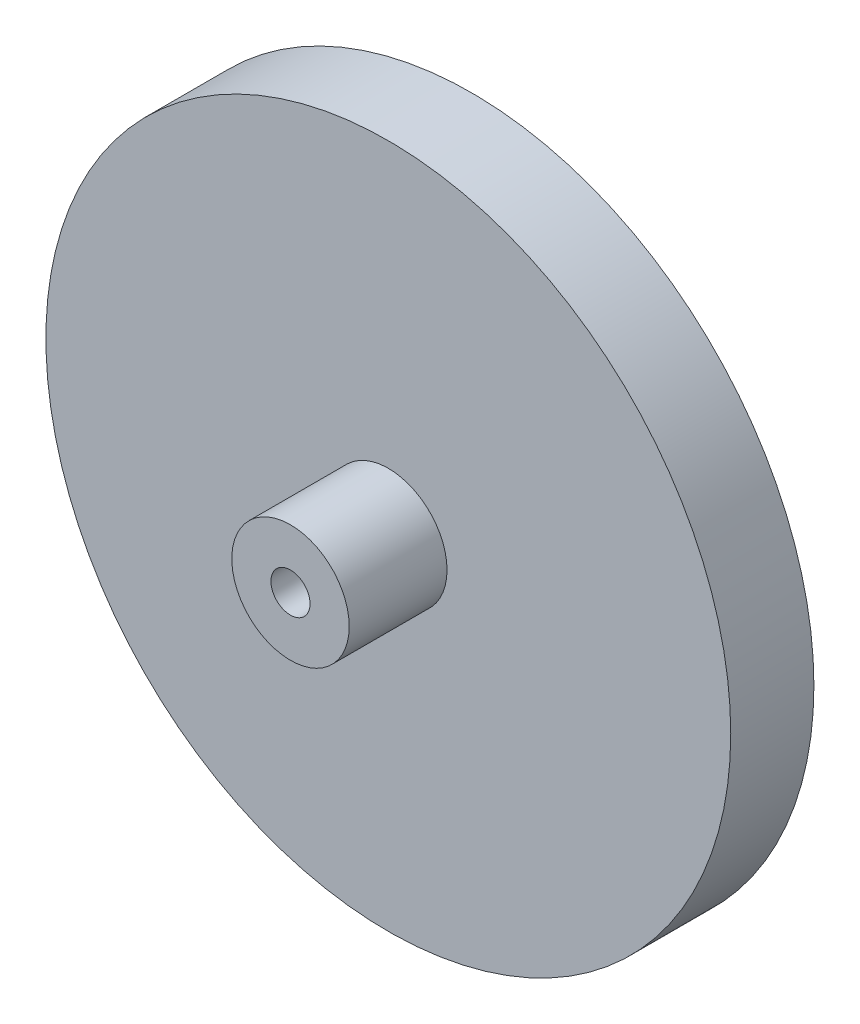
ISO-10303-21;
HEADER;
FILE_DESCRIPTION(('STEP AP214'),'2;1');
FILE_NAME('part.step','',(''),(''),'','','');
FILE_SCHEMA(('AUTOMOTIVE_DESIGN { 1 0 10303 214 1 1 1 1 }'));
ENDSEC;
DATA;
#1=APPLICATION_CONTEXT('core data for automotive mechanical design processes');
#2=APPLICATION_PROTOCOL_DEFINITION('international standard','automotive_design',2000,#1);
#3=PRODUCT_CONTEXT('',#1,'mechanical');
#4=PRODUCT('Part','Part','',(#3));
#5=PRODUCT_RELATED_PRODUCT_CATEGORY('part','',(#4));
#6=PRODUCT_DEFINITION_FORMATION('','',#4);
#7=PRODUCT_DEFINITION_CONTEXT('part definition',#1,'design');
#8=PRODUCT_DEFINITION('design','',#6,#7);
#9=PRODUCT_DEFINITION_SHAPE('','',#8);
#10=(LENGTH_UNIT() NAMED_UNIT(*) SI_UNIT(.MILLI.,.METRE.));
#11=(NAMED_UNIT(*) PLANE_ANGLE_UNIT() SI_UNIT($,.RADIAN.));
#12=(NAMED_UNIT(*) SI_UNIT($,.STERADIAN.) SOLID_ANGLE_UNIT());
#13=UNCERTAINTY_MEASURE_WITH_UNIT(LENGTH_MEASURE(1.E-05),#10,'distance_accuracy_value','');
#14=(GEOMETRIC_REPRESENTATION_CONTEXT(3) GLOBAL_UNCERTAINTY_ASSIGNED_CONTEXT((#13)) GLOBAL_UNIT_ASSIGNED_CONTEXT((#10,
#11,#12)) REPRESENTATION_CONTEXT('',''));
#15=CARTESIAN_POINT('',(0.,0.,0.));
#16=DIRECTION('',(0.,0.,1.));
#17=DIRECTION('',(1.,0.,0.));
#18=AXIS2_PLACEMENT_3D('',#15,#16,#17);
#19=CARTESIAN_POINT('',(0.,0.,8.5));
#20=DIRECTION('',(0.,0.,1.));
#21=DIRECTION('',(1.,0.,0.));
#22=AXIS2_PLACEMENT_3D('',#19,#20,#21);
#23=PLANE('',#22);
#24=CARTESIAN_POINT('',(0.,0.,8.5));
#25=DIRECTION('',(0.,0.,1.));
#26=DIRECTION('',(1.,0.,0.));
#27=AXIS2_PLACEMENT_3D('',#24,#25,#26);
#28=CIRCLE('',#27,35.);
#29=CARTESIAN_POINT('',(35.,0.,8.5));
#30=VERTEX_POINT('',#29);
#31=EDGE_CURVE('E10',#30,#30,#28,.T.);
#32=ORIENTED_EDGE('',*,*,#31,.T.);
#33=EDGE_LOOP('',(#32));
#34=FACE_BOUND('',#33,.T.);
#35=CARTESIAN_POINT('',(0.,0.,8.5));
#36=DIRECTION('',(0.,0.,1.));
#37=DIRECTION('',(1.,0.,0.));
#38=AXIS2_PLACEMENT_3D('',#35,#36,#37);
#39=CIRCLE('',#38,6.);
#40=CARTESIAN_POINT('',(6.,0.,8.5));
#41=VERTEX_POINT('',#40);
#42=EDGE_CURVE('E47',#41,#41,#39,.T.);
#43=ORIENTED_EDGE('',*,*,#42,.F.);
#44=EDGE_LOOP('',(#43));
#45=FACE_BOUND('',#44,.T.);
#46=ADVANCED_FACE('F31',(#34,#45),#23,.T.);
#47=CARTESIAN_POINT('',(0.,0.,0.));
#48=DIRECTION('',(0.,0.,1.));
#49=DIRECTION('',(1.,0.,0.));
#50=AXIS2_PLACEMENT_3D('',#47,#48,#49);
#51=PLANE('',#50);
#52=CARTESIAN_POINT('',(0.,0.,0.));
#53=DIRECTION('',(0.,0.,1.));
#54=DIRECTION('',(1.,0.,0.));
#55=AXIS2_PLACEMENT_3D('',#52,#53,#54);
#56=CIRCLE('',#55,35.);
#57=CARTESIAN_POINT('',(35.,0.,0.));
#58=VERTEX_POINT('',#57);
#59=EDGE_CURVE('E35',#58,#58,#56,.T.);
#60=ORIENTED_EDGE('',*,*,#59,.F.);
#61=EDGE_LOOP('',(#60));
#62=FACE_BOUND('',#61,.T.);
#63=CARTESIAN_POINT('',(0.,0.,0.));
#64=DIRECTION('',(0.,0.,1.));
#65=DIRECTION('',(1.,0.,0.));
#66=AXIS2_PLACEMENT_3D('',#63,#64,#65);
#67=CIRCLE('',#66,2.);
#68=CARTESIAN_POINT('',(2.,0.,0.));
#69=VERTEX_POINT('',#68);
#70=EDGE_CURVE('E42',#69,#69,#67,.T.);
#71=ORIENTED_EDGE('',*,*,#70,.T.);
#72=EDGE_LOOP('',(#71));
#73=FACE_BOUND('',#72,.T.);
#74=ADVANCED_FACE('F72',(#62,#73),#51,.F.);
#75=CARTESIAN_POINT('',(0.,0.,8.5));
#76=DIRECTION('',(0.,0.,-1.));
#77=DIRECTION('',(-1.,0.,0.));
#78=AXIS2_PLACEMENT_3D('',#75,#76,#77);
#79=CYLINDRICAL_SURFACE('',#78,35.);
#80=ORIENTED_EDGE('',*,*,#31,.F.);
#81=EDGE_LOOP('',(#80));
#82=FACE_BOUND('',#81,.T.);
#83=ORIENTED_EDGE('',*,*,#59,.T.);
#84=EDGE_LOOP('',(#83));
#85=FACE_BOUND('',#84,.T.);
#86=ADVANCED_FACE('F33',(#82,#85),#79,.T.);
#87=CARTESIAN_POINT('',(0.,0.,8.5));
#88=DIRECTION('',(0.,0.,-1.));
#89=DIRECTION('',(-1.,0.,0.));
#90=AXIS2_PLACEMENT_3D('',#87,#88,#89);
#91=CYLINDRICAL_SURFACE('',#90,2.);
#92=ORIENTED_EDGE('',*,*,#70,.F.);
#93=EDGE_LOOP('',(#92));
#94=FACE_BOUND('',#93,.T.);
#95=CARTESIAN_POINT('',(0.,0.,18.5));
#96=DIRECTION('',(0.,0.,1.));
#97=DIRECTION('',(1.,0.,0.));
#98=AXIS2_PLACEMENT_3D('',#95,#96,#97);
#99=CIRCLE('',#98,2.);
#100=CARTESIAN_POINT('',(2.,0.,18.5));
#101=VERTEX_POINT('',#100);
#102=EDGE_CURVE('E50',#101,#101,#99,.T.);
#103=ORIENTED_EDGE('',*,*,#102,.T.);
#104=EDGE_LOOP('',(#103));
#105=FACE_BOUND('',#104,.T.);
#106=ADVANCED_FACE('F56',(#94,#105),#91,.F.);
#107=CARTESIAN_POINT('',(0.,0.,18.5));
#108=DIRECTION('',(0.,0.,1.));
#109=DIRECTION('',(1.,0.,0.));
#110=AXIS2_PLACEMENT_3D('',#107,#108,#109);
#111=PLANE('',#110);
#112=CARTESIAN_POINT('',(0.,0.,18.5));
#113=DIRECTION('',(0.,0.,1.));
#114=DIRECTION('',(1.,0.,0.));
#115=AXIS2_PLACEMENT_3D('',#112,#113,#114);
#116=CIRCLE('',#115,6.);
#117=CARTESIAN_POINT('',(6.,0.,18.5));
#118=VERTEX_POINT('',#117);
#119=EDGE_CURVE('E46',#118,#118,#116,.T.);
#120=ORIENTED_EDGE('',*,*,#119,.T.);
#121=EDGE_LOOP('',(#120));
#122=FACE_BOUND('',#121,.T.);
#123=ORIENTED_EDGE('',*,*,#102,.F.);
#124=EDGE_LOOP('',(#123));
#125=FACE_BOUND('',#124,.T.);
#126=ADVANCED_FACE('F58',(#122,#125),#111,.T.);
#127=CARTESIAN_POINT('',(0.,0.,18.5));
#128=DIRECTION('',(0.,0.,-1.));
#129=DIRECTION('',(-1.,0.,0.));
#130=AXIS2_PLACEMENT_3D('',#127,#128,#129);
#131=CYLINDRICAL_SURFACE('',#130,6.);
#132=ORIENTED_EDGE('',*,*,#119,.F.);
#133=EDGE_LOOP('',(#132));
#134=FACE_BOUND('',#133,.T.);
#135=ORIENTED_EDGE('',*,*,#42,.T.);
#136=EDGE_LOOP('',(#135));
#137=FACE_BOUND('',#136,.T.);
#138=ADVANCED_FACE('F60',(#134,#137),#131,.T.);
#139=CLOSED_SHELL('',(#46,#74,#86,#106,#126,#138));
#140=MANIFOLD_SOLID_BREP('B2',#139);
#141=ADVANCED_BREP_SHAPE_REPRESENTATION('',(#18,#140),#14);
#142=SHAPE_DEFINITION_REPRESENTATION(#9,#141);
ENDSEC;
END-ISO-10303-21;
